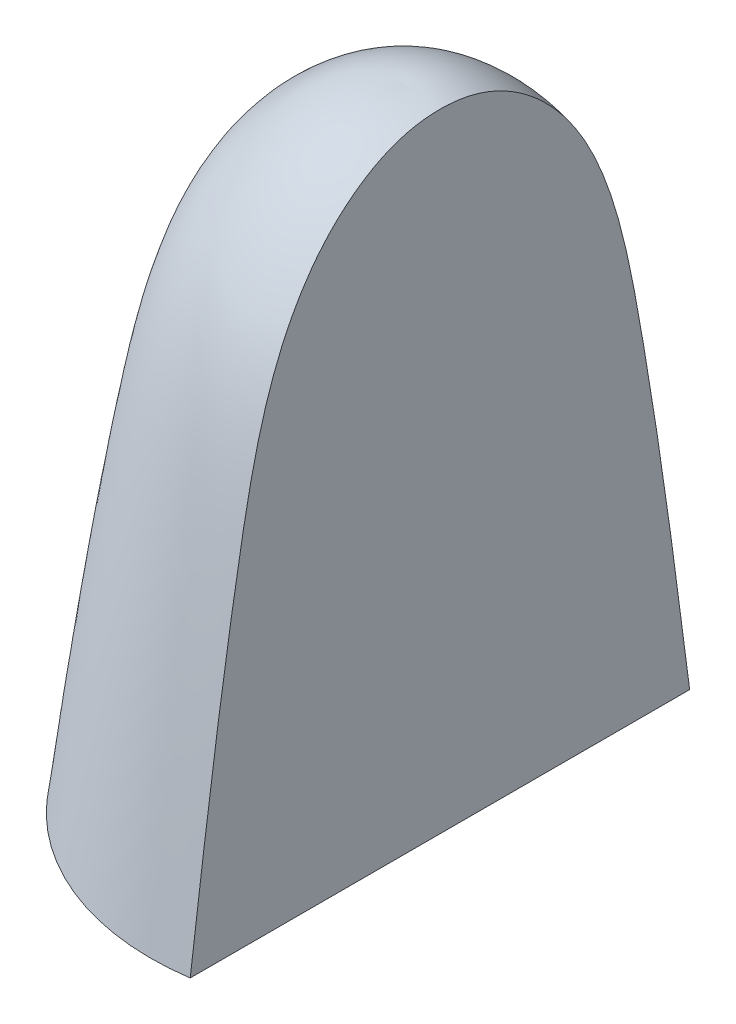
ISO-10303-21;
HEADER;
FILE_DESCRIPTION(('STEP AP214'),'2;1');
FILE_NAME('part.step','',(''),(''),'','','');
FILE_SCHEMA(('AUTOMOTIVE_DESIGN { 1 0 10303 214 1 1 1 1 }'));
ENDSEC;
DATA;
#1=APPLICATION_CONTEXT('core data for automotive mechanical design processes');
#2=APPLICATION_PROTOCOL_DEFINITION('international standard','automotive_design',2000,#1);
#3=PRODUCT_CONTEXT('',#1,'mechanical');
#4=PRODUCT('Part','Part','',(#3));
#5=PRODUCT_RELATED_PRODUCT_CATEGORY('part','',(#4));
#6=PRODUCT_DEFINITION_FORMATION('','',#4);
#7=PRODUCT_DEFINITION_CONTEXT('part definition',#1,'design');
#8=PRODUCT_DEFINITION('design','',#6,#7);
#9=PRODUCT_DEFINITION_SHAPE('','',#8);
#10=(LENGTH_UNIT() NAMED_UNIT(*) SI_UNIT(.MILLI.,.METRE.));
#11=(NAMED_UNIT(*) PLANE_ANGLE_UNIT() SI_UNIT($,.RADIAN.));
#12=(NAMED_UNIT(*) SI_UNIT($,.STERADIAN.) SOLID_ANGLE_UNIT());
#13=UNCERTAINTY_MEASURE_WITH_UNIT(LENGTH_MEASURE(1.E-05),#10,'distance_accuracy_value','');
#14=(GEOMETRIC_REPRESENTATION_CONTEXT(3) GLOBAL_UNCERTAINTY_ASSIGNED_CONTEXT((#13)) GLOBAL_UNIT_ASSIGNED_CONTEXT((#10,
#11,#12)) REPRESENTATION_CONTEXT('',''));
#15=CARTESIAN_POINT('',(0.,0.,0.));
#16=DIRECTION('',(0.,0.,1.));
#17=DIRECTION('',(1.,0.,0.));
#18=AXIS2_PLACEMENT_3D('',#15,#16,#17);
#19=CARTESIAN_POINT('',(4.88,0.,0.));
#20=DIRECTION('',(0.,1.,0.));
#21=DIRECTION('',(0.,0.,1.));
#22=AXIS2_PLACEMENT_3D('',#19,#20,#21);
#23=PLANE('',#22);
#24=DIRECTION('',(0.,0.,1.));
#25=VECTOR('',#24,1.);
#26=CARTESIAN_POINT('',(0.,0.,0.));
#27=LINE('',#26,#25);
#28=CARTESIAN_POINT('',(0.,0.,-4.88));
#29=VERTEX_POINT('',#28);
#30=CARTESIAN_POINT('',(0.,0.,4.88));
#31=VERTEX_POINT('',#30);
#32=EDGE_CURVE('E85',#29,#31,#27,.T.);
#33=ORIENTED_EDGE('',*,*,#32,.F.);
#34=CARTESIAN_POINT('',(0.,0.,0.));
#35=DIRECTION('',(0.,1.,0.));
#36=DIRECTION('',(0.,0.,1.));
#37=AXIS2_PLACEMENT_3D('',#34,#35,#36);
#38=CIRCLE('',#37,4.88);
#39=EDGE_CURVE('E88',#29,#31,#38,.T.);
#40=ORIENTED_EDGE('',*,*,#39,.T.);
#41=EDGE_LOOP('',(#33,#40));
#42=FACE_BOUND('',#41,.T.);
#43=DIRECTION('',(0.,0.,-1.));
#44=VECTOR('',#43,1.);
#45=CARTESIAN_POINT('',(1.,0.,0.));
#46=LINE('',#45,#44);
#47=CARTESIAN_POINT('',(1.,0.,6.8069376374402));
#48=VERTEX_POINT('',#47);
#49=CARTESIAN_POINT('',(1.,0.,-6.8069376374402));
#50=VERTEX_POINT('',#49);
#51=EDGE_CURVE('E52',#48,#50,#46,.T.);
#52=ORIENTED_EDGE('',*,*,#51,.F.);
#53=CARTESIAN_POINT('',(0.,0.,0.));
#54=DIRECTION('',(0.,1.,0.));
#55=DIRECTION('',(0.,0.,1.));
#56=AXIS2_PLACEMENT_3D('',#53,#54,#55);
#57=CIRCLE('',#56,6.88);
#58=EDGE_CURVE('E84',#50,#48,#57,.T.);
#59=ORIENTED_EDGE('',*,*,#58,.F.);
#60=EDGE_LOOP('',(#52,#59));
#61=FACE_BOUND('',#60,.T.);
#62=ADVANCED_FACE('F33',(#42,#61),#23,.F.);
#63=CARTESIAN_POINT('',(6.88,0.,0.));
#64=CARTESIAN_POINT('',(6.47690165518344,3.17769283241905,0.));
#65=CARTESIAN_POINT('',(5.80886829189499,8.35775424687315,0.));
#66=CARTESIAN_POINT('',(4.37828927648046,15.4645962006851,0.));
#67=CARTESIAN_POINT('',(1.11106057892877,17.2802335156458,0.));
#68=CARTESIAN_POINT('',(0.,17.2,0.));
#69=B_SPLINE_CURVE_WITH_KNOTS('',3,(#63,#64,#65,#66,#67,#68),.UNSPECIFIED.,.F.,.F.,(4,1,1,4),
(0.,0.473754928065121,0.83849243058151,1.),.UNSPECIFIED.);
#70=CARTESIAN_POINT('',(0.,18.0579057061154,0.));
#71=DIRECTION('',(0.,1.,0.));
#72=AXIS1_PLACEMENT('',#70,#71);
#73=SURFACE_OF_REVOLUTION('',#69,#72);
#74=CARTESIAN_POINT('',(0.,17.2,0.));
#75=VERTEX_POINT('',#74);
#76=VERTEX_LOOP('',#75);
#77=FACE_BOUND('',#76,.T.);
#78=CARTESIAN_POINT('',(1.,0.,-6.8069376374402));
#79=CARTESIAN_POINT('',(1.,0.325630724910655,-6.76518373550329));
#80=CARTESIAN_POINT('',(1.,0.651253473278133,-6.7233642438564));
#81=CARTESIAN_POINT('',(1.,1.30351985313046,-6.63913779643726));
#82=CARTESIAN_POINT('',(1.,1.63016329230628,-6.5967293532776));
#83=CARTESIAN_POINT('',(1.,2.28420434834058,-6.51102917643607));
#84=CARTESIAN_POINT('',(1.,2.61160170115588,-6.46773542117755));
#85=CARTESIAN_POINT('',(1.,3.26688126965538,-6.37995188866716));
#86=CARTESIAN_POINT('',(1.,3.59476319775362,-6.33545995928494));
#87=CARTESIAN_POINT('',(1.,4.25074316902371,-6.2449711752896));
#88=CARTESIAN_POINT('',(1.,4.5788409596492,-6.19897248531578));
#89=CARTESIAN_POINT('',(1.,5.2349861630474,-6.10517878849851));
#90=CARTESIAN_POINT('',(1.,5.56303342070914,-6.05738269418856));
#91=CARTESIAN_POINT('',(1.,6.23911470271178,-5.95671223634639));
#92=CARTESIAN_POINT('',(1.,6.58712922706167,-5.90370665303548));
#93=CARTESIAN_POINT('',(1.,7.28260491822555,-5.79510441209983));
#94=CARTESIAN_POINT('',(1.,7.63006625625954,-5.73950885409394));
#95=CARTESIAN_POINT('',(1.,8.15076053294847,-5.65400676545338));
#96=CARTESIAN_POINT('',(1.,8.3241691708583,-5.6251672410478));
#97=CARTESIAN_POINT('',(1.,8.67086436631517,-5.56675582456074));
#98=CARTESIAN_POINT('',(1.,8.84415092308082,-5.53718392783465));
#99=CARTESIAN_POINT('',(1.,9.10387448944329,-5.49228070846698));
#100=CARTESIAN_POINT('',(1.,9.1903603823503,-5.47723169501576));
#101=CARTESIAN_POINT('',(1.,9.36329907182524,-5.44694479601924));
#102=CARTESIAN_POINT('',(1.,9.4497518683796,-5.43170691039652));
#103=CARTESIAN_POINT('',(1.,9.70903044976889,-5.38554687526954));
#104=CARTESIAN_POINT('',(1.,9.8817775984942,-5.3541781471419));
#105=CARTESIAN_POINT('',(1.,10.2266383602988,-5.28943838767826));
#106=CARTESIAN_POINT('',(1.,10.3987525302671,-5.25607034908394));
#107=CARTESIAN_POINT('',(1.,10.7424036282819,-5.18643548096292));
#108=CARTESIAN_POINT('',(1.,10.9139405407412,-5.1501685738042));
#109=CARTESIAN_POINT('',(1.,11.2561398475446,-5.07386867623961));
#110=CARTESIAN_POINT('',(1.,11.4268024321778,-5.03383654551293));
#111=CARTESIAN_POINT('',(1.,11.7669547684463,-4.94908748588783));
#112=CARTESIAN_POINT('',(1.,11.9364446381214,-4.9043710360243));
#113=CARTESIAN_POINT('',(1.,12.2186448331177,-4.82483876658157));
#114=CARTESIAN_POINT('',(1.,12.3317910862566,-4.79156964529218));
#115=CARTESIAN_POINT('',(1.,12.5572074840467,-4.72216050903644));
#116=CARTESIAN_POINT('',(1.,12.6694775996119,-4.6860203992));
#117=CARTESIAN_POINT('',(1.,12.892949141258,-4.61054984847056));
#118=CARTESIAN_POINT('',(1.,13.0041505237877,-4.57121927817673));
#119=CARTESIAN_POINT('',(1.,13.2248506998165,-4.48918974666945));
#120=CARTESIAN_POINT('',(1.,13.3343541936387,-4.44650347075803));
#121=CARTESIAN_POINT('',(1.,13.5518114820349,-4.35730537690135));
#122=CARTESIAN_POINT('',(1.,13.6597651214702,-4.31079317907875));
#123=CARTESIAN_POINT('',(1.,13.873798179127,-4.21362034556357));
#124=CARTESIAN_POINT('',(1.,13.9798774630547,-4.1629594140761));
#125=CARTESIAN_POINT('',(1.,14.2442558566948,-4.02972818894831));
#126=CARTESIAN_POINT('',(1.,14.4011025571077,-3.94423618672721));
#127=CARTESIAN_POINT('',(1.,14.7081254864984,-3.76196383121557));
#128=CARTESIAN_POINT('',(0.999999999999999,14.858301920545,-3.66518382529215));
#129=CARTESIAN_POINT('',(1.,15.1502452259197,-3.45961208819087));
#130=CARTESIAN_POINT('',(1.00000000000001,15.2920120325885,-3.35082026467591));
#131=CARTESIAN_POINT('',(0.999999999999993,15.5651897070575,-3.12092349296525));
#132=CARTESIAN_POINT('',(0.999999999999972,15.6966036483847,-2.99982222379811));
#133=CARTESIAN_POINT('',(0.999999999999979,15.9090810342319,-2.78426965377604));
#134=CARTESIAN_POINT('',(0.999999999999995,15.9933027534781,-2.69291406131553));
#135=CARTESIAN_POINT('',(1.00000000000001,16.1551705918999,-2.50453400701932));
#136=CARTESIAN_POINT('',(1.,16.232817122197,-2.40750990025634));
#137=CARTESIAN_POINT('',(0.999999999999999,16.3803975765514,-2.20798317453374));
#138=CARTESIAN_POINT('',(1.,16.4503436940124,-2.10548960991976));
#139=CARTESIAN_POINT('',(1.,16.5814804128002,-1.89503426851931));
#140=CARTESIAN_POINT('',(1.,16.6426726862794,-1.78707354141495));
#141=CARTESIAN_POINT('',(1.,16.7458499010108,-1.58399007412601));
#142=CARTESIAN_POINT('',(1.,16.7893401615443,-1.48963244751748));
#143=CARTESIAN_POINT('',(1.,16.8684663428114,-1.2976860907947));
#144=CARTESIAN_POINT('',(1.,16.904104080725,-1.20009811425233));
#145=CARTESIAN_POINT('',(1.,16.9668758424214,-1.00217582353099));
#146=CARTESIAN_POINT('',(1.,16.9940067437563,-0.901840515598335));
#147=CARTESIAN_POINT('',(1.,17.0393553411734,-0.699169088723154));
#148=CARTESIAN_POINT('',(1.,17.0575725533354,-0.596832861465198));
#149=CARTESIAN_POINT('',(1.,17.085128351924,-0.390940077489392));
#150=CARTESIAN_POINT('',(1.,17.0944633649685,-0.287383046579562));
#151=CARTESIAN_POINT('',(1.,17.1045564194792,-0.0798435310542998));
#152=CARTESIAN_POINT('',(1.,17.1053131164444,0.0241390176988233));
#153=CARTESIAN_POINT('',(1.,17.0982910700647,0.231757145355891));
#154=CARTESIAN_POINT('',(1.,17.0905175908188,0.335392898704497));
#155=CARTESIAN_POINT('',(1.,17.0661386231189,0.541606437185932));
#156=CARTESIAN_POINT('',(1.,17.0495352248645,0.644184466845228));
#157=CARTESIAN_POINT('',(1.,17.0073986232804,0.847449796567969));
#158=CARTESIAN_POINT('',(1.,16.9818689106768,0.948137819542963));
#159=CARTESIAN_POINT('',(1.,16.9222004958238,1.14692926615582));
#160=CARTESIAN_POINT('',(1.,16.8880610864179,1.24503247675905));
#161=CARTESIAN_POINT('',(1.,16.811766122454,1.43817911998058));
#162=CARTESIAN_POINT('',(1.,16.7696020313018,1.53321916697461));
#163=CARTESIAN_POINT('',(1.,16.6780378957834,1.71978317009742));
#164=CARTESIAN_POINT('',(1.,16.6286340991481,1.81130527167035));
#165=CARTESIAN_POINT('',(1.,16.5048092158707,2.02220966681855));
#166=CARTESIAN_POINT('',(1.,16.4277118126913,2.14002724153519));
#167=CARTESIAN_POINT('',(1.,16.2635424264656,2.36844283285249));
#168=CARTESIAN_POINT('',(1.,16.1764668513271,2.47903822686907));
#169=CARTESIAN_POINT('',(1.,15.9024935010686,2.79990233734617));
#170=CARTESIAN_POINT('',(1.,15.7027358619353,2.99943418646462));
#171=CARTESIAN_POINT('',(1.,15.3928056084428,3.26757693012212));
#172=CARTESIAN_POINT('',(1.,15.2928353835745,3.34848066450858));
#173=CARTESIAN_POINT('',(1.,15.0880346673323,3.50403566921137));
#174=CARTESIAN_POINT('',(1.,14.9832020688562,3.57868418876094));
#175=CARTESIAN_POINT('',(1.,14.7694244196884,3.72184897244149));
#176=CARTESIAN_POINT('',(1.,14.6604785067774,3.79036394061711));
#177=CARTESIAN_POINT('',(1.,14.4388365611266,3.92171580713985));
#178=CARTESIAN_POINT('',(1.,14.3261314030833,3.98453726772779));
#179=CARTESIAN_POINT('',(1.,14.0978636756859,4.10463869346656));
#180=CARTESIAN_POINT('',(1.,13.982302057936,4.16192047368718));
#181=CARTESIAN_POINT('',(1.,13.7488770930997,4.27133055660323));
#182=CARTESIAN_POINT('',(1.,13.6310154056141,4.32346242170285));
#183=CARTESIAN_POINT('',(1.,13.2187402211602,4.49621877597788));
#184=CARTESIAN_POINT('',(1.,12.9193164074057,4.60495871881363));
#185=CARTESIAN_POINT('',(1.,12.313160346503,4.80051813553175));
#186=CARTESIAN_POINT('',(1.,12.0064175984661,4.88730374723454));
#187=CARTESIAN_POINT('',(1.,11.3877766589818,5.04509578818482));
#188=CARTESIAN_POINT('',(1.,11.075863653563,5.11604299756951));
#189=CARTESIAN_POINT('',(1.,10.6059487597747,5.21451770021536));
#190=CARTESIAN_POINT('',(1.,10.44875454059,5.24605568024259));
#191=CARTESIAN_POINT('',(1.,10.1339696996392,5.3070980812102));
#192=CARTESIAN_POINT('',(1.,9.97637907758946,5.33660250069485));
#193=CARTESIAN_POINT('',(1.,9.66095238364621,5.39421614948321));
#194=CARTESIAN_POINT('',(1.,9.50311632095862,5.42232542987273));
#195=CARTESIAN_POINT('',(1.,9.1873236436048,5.47785375048928));
#196=CARTESIAN_POINT('',(1.,9.02936702926569,5.50527279258253));
#197=CARTESIAN_POINT('',(1.,8.71157512891945,5.55980887427358));
#198=CARTESIAN_POINT('',(1.,8.55173866698994,5.58691906383199));
#199=CARTESIAN_POINT('',(1.,8.23196174349966,5.64051646427551));
#200=CARTESIAN_POINT('',(1.,8.0720212821457,5.66700367639563));
#201=CARTESIAN_POINT('',(1.,7.59287945564179,5.74542981041913));
#202=CARTESIAN_POINT('',(1.,7.27353140934863,5.79647483299838));
#203=CARTESIAN_POINT('',(1.,6.63500901646421,5.89627368474961));
#204=CARTESIAN_POINT('',(1.,6.31583522837623,5.94503109613245));
#205=CARTESIAN_POINT('',(1.,5.67740543995403,6.04053663011164));
#206=CARTESIAN_POINT('',(1.,5.35814963671147,6.08728607220366));
#207=CARTESIAN_POINT('',(1.,4.71930413137382,6.17908284350568));
#208=CARTESIAN_POINT('',(1.,4.39971436154091,6.22412970045101));
#209=CARTESIAN_POINT('',(1.,3.90926493029905,6.29214406194618));
#210=CARTESIAN_POINT('',(1.,3.73847568222654,6.31562131142407));
#211=CARTESIAN_POINT('',(1.,3.3967632415407,6.36222687449056));
#212=CARTESIAN_POINT('',(1.,3.22584002451562,6.38535500914882));
#213=CARTESIAN_POINT('',(1.,2.88389480560939,6.43130515751945));
#214=CARTESIAN_POINT('',(1.,2.71287278976421,6.45412706721072));
#215=CARTESIAN_POINT('',(1.,2.37076516339941,6.49950840024231));
#216=CARTESIAN_POINT('',(1.,2.19967954703954,6.52206777952893));
#217=CARTESIAN_POINT('',(1.,1.85950073294312,6.56670266264592));
#218=CARTESIAN_POINT('',(1.,1.69040787189081,6.58878073443648));
#219=CARTESIAN_POINT('',(1.,1.35222856661231,6.63276507481999));
#220=CARTESIAN_POINT('',(1.,1.18314212603904,6.65467137151688));
#221=CARTESIAN_POINT('',(1.,0.845009687406819,6.69835319024418));
#222=CARTESIAN_POINT('',(1.,0.675963694661787,6.72012875344397));
#223=CARTESIAN_POINT('',(1.,0.337945932863498,6.76358837022412));
#224=CARTESIAN_POINT('',(1.,0.168974168998467,6.78527246414375));
#225=CARTESIAN_POINT('',(1.,0.,6.8069376374402));
#226=B_SPLINE_CURVE_WITH_KNOTS('',3,(#78,#79,#80,#81,#82,#83,#84,#85,#86,#87,#88,#89,#90,#91,
#92,#93,#94,#95,#96,#97,#98,#99,#100,#101,#102,#103,#104,#105,#106,#107,#108,#109,#110,#111,
#112,#113,#114,#115,#116,#117,#118,#119,#120,#121,#122,#123,#124,#125,#126,#127,#128,#129,#130,
#131,#132,#133,#134,#135,#136,#137,#138,#139,#140,#141,#142,#143,#144,#145,#146,#147,#148,#149,
#150,#151,#152,#153,#154,#155,#156,#157,#158,#159,#160,#161,#162,#163,#164,#165,#166,#167,#168,
#169,#170,#171,#172,#173,#174,#175,#176,#177,#178,#179,#180,#181,#182,#183,#184,#185,#186,#187,
#188,#189,#190,#191,#192,#193,#194,#195,#196,#197,#198,#199,#200,#201,#202,#203,#204,#205,#206,
#207,#208,#209,#210,#211,#212,#213,#214,#215,#216,#217,#218,#219,#220,#221,#222,#223,#224,#225),
.UNSPECIFIED.,.F.,.F.,(4,2,2,2,2,2,2,2,2,2,2,2,2,2,2,2,2,2,2,2,2,2,2,2,2,2,2,2,2,2,2,2,2,2,2,2,
2,2,2,2,2,2,2,2,2,2,2,2,2,2,2,2,2,2,2,2,2,2,2,2,2,2,2,2,2,2,2,2,2,2,2,2,2,4),(0.,
0.984890943744065,1.97304523803312,2.96378620094933,3.95644417958091,4.95035988641057,
5.94488692536696,7.00096224815413,8.05659321093775,8.58396321759192,9.11133656961654,
9.37469266193548,9.63804886222473,10.1647576953517,10.690696901358,11.2166501967967,
11.742483696285,12.2682634745952,12.6220393819107,12.975826984407,13.3296289432399,
13.682152432191,14.0347109656917,14.3872946577023,14.922752745355,15.4581943596352,
15.9936400902422,16.5289262555884,16.9014215957282,17.273893627923,17.6457671093511,
18.0175694606791,18.3289464358566,18.640251278337,18.9516702523532,19.2631061312907,
19.5746672505479,19.8862772008878,20.1976949601657,20.5090390340906,20.8202614896727,
21.1315095158048,21.443090514829,21.7548335781879,22.1765785781657,22.598475884064,
23.4416265896366,23.8272861979642,24.2131145218962,24.5990241758597,24.9859507228708,
25.3727500612588,25.759279933286,26.7136298536801,27.6694429019495,28.628772014043,
29.1097456406348,29.5907196115311,30.0716759575908,30.5526310031282,31.0389875177998,
31.5253430682212,32.495539379721,33.4641619466859,34.4321379483444,35.4003805065352,
35.917566166168,36.4350084643139,36.9526222952441,37.4703217665807,37.9819059960161,
38.4934047020968,39.0047328563696,39.5158051387089),.UNSPECIFIED.);
#227=EDGE_CURVE('E11',#50,#48,#226,.T.);
#228=ORIENTED_EDGE('',*,*,#227,.F.);
#229=ORIENTED_EDGE('',*,*,#58,.T.);
#230=EDGE_LOOP('',(#228,#229));
#231=FACE_BOUND('',#230,.T.);
#232=ADVANCED_FACE('F87',(#77,#231),#73,.T.);
#233=CARTESIAN_POINT('',(0.,0.803124562942561,0.));
#234=DIRECTION('',(0.,1.,0.));
#235=DIRECTION('',(0.,0.,1.));
#236=AXIS2_PLACEMENT_3D('',#233,#234,#235);
#237=DEGENERATE_TOROIDAL_SURFACE('',#236,7.58838532482872,12.4942243325468,.F.);
#238=CARTESIAN_POINT('',(0.,0.803124562942561,7.58838532482872));
#239=DIRECTION('',(1.,0.,0.));
#240=DIRECTION('',(0.,0.,-1.));
#241=AXIS2_PLACEMENT_3D('',#238,#239,#240);
#242=CIRCLE('',#241,12.4942243325468);
#243=CARTESIAN_POINT('',(0.,1.60624912588512,-4.88));
#244=VERTEX_POINT('',#243);
#245=EDGE_CURVE('E113',#244,#29,#242,.F.);
#246=ORIENTED_EDGE('',*,*,#245,.F.);
#247=CARTESIAN_POINT('',(0.,1.60624912588512,0.));
#248=DIRECTION('',(0.,1.,0.));
#249=DIRECTION('',(0.,0.,1.));
#250=AXIS2_PLACEMENT_3D('',#247,#248,#249);
#251=CIRCLE('',#250,4.88);
#252=CARTESIAN_POINT('',(0.,1.60624912588512,4.88));
#253=VERTEX_POINT('',#252);
#254=EDGE_CURVE('E95',#244,#253,#251,.T.);
#255=ORIENTED_EDGE('',*,*,#254,.T.);
#256=CARTESIAN_POINT('',(0.,0.803124562942561,-7.58838532482872));
#257=DIRECTION('',(1.,0.,0.));
#258=DIRECTION('',(0.,0.,-1.));
#259=AXIS2_PLACEMENT_3D('',#256,#257,#258);
#260=CIRCLE('',#259,12.4942243325468);
#261=EDGE_CURVE('E124',#31,#253,#260,.F.);
#262=ORIENTED_EDGE('',*,*,#261,.F.);
#263=ORIENTED_EDGE('',*,*,#39,.F.);
#264=EDGE_LOOP('',(#246,#255,#262,#263));
#265=FACE_BOUND('',#264,.T.);
#266=ADVANCED_FACE('F35',(#265),#237,.T.);
#267=CARTESIAN_POINT('',(0.,15.4,0.));
#268=CARTESIAN_POINT('',(1.56302961911326,15.2977602080588,0.));
#269=CARTESIAN_POINT('',(2.28424319668184,13.6331974498387,0.));
#270=B_SPLINE_CURVE_WITH_KNOTS('',2,(#267,#268,#269),.UNSPECIFIED.,.F.,.F.,(3,3),(0.,1.),.UNSPECIFIED.);
#271=CARTESIAN_POINT('',(0.,18.0579057061154,0.));
#272=DIRECTION('',(0.,1.,0.));
#273=AXIS1_PLACEMENT('',#271,#272);
#274=SURFACE_OF_REVOLUTION('',#270,#273);
#275=CARTESIAN_POINT('',(0.,15.4,0.));
#276=CARTESIAN_POINT('',(0.,15.2977602080588,-1.56302961911326));
#277=CARTESIAN_POINT('',(0.,13.6331974498387,-2.28424319668184));
#278=B_SPLINE_CURVE_WITH_KNOTS('',2,(#275,#276,#277),.UNSPECIFIED.,.F.,.F.,(3,3),(0.,1.),.UNSPECIFIED.);
#279=CARTESIAN_POINT('',(0.,15.4,0.));
#280=VERTEX_POINT('',#279);
#281=CARTESIAN_POINT('',(0.,13.6331974498387,-2.28424319668184));
#282=VERTEX_POINT('',#281);
#283=EDGE_CURVE('E116',#280,#282,#278,.T.);
#284=ORIENTED_EDGE('',*,*,#283,.F.);
#285=CARTESIAN_POINT('',(0.,15.4,0.));
#286=CARTESIAN_POINT('',(0.,15.2977602080588,1.56302961911326));
#287=CARTESIAN_POINT('',(0.,13.6331974498387,2.28424319668184));
#288=B_SPLINE_CURVE_WITH_KNOTS('',2,(#285,#286,#287),.UNSPECIFIED.,.F.,.F.,(3,3),(0.,1.),.UNSPECIFIED.);
#289=CARTESIAN_POINT('',(0.,13.6331974498387,2.28424319668184));
#290=VERTEX_POINT('',#289);
#291=EDGE_CURVE('E160',#290,#280,#288,.F.);
#292=ORIENTED_EDGE('',*,*,#291,.F.);
#293=CARTESIAN_POINT('',(0.,13.6331974498387,0.));
#294=DIRECTION('',(0.,1.,0.));
#295=DIRECTION('',(0.,0.,1.));
#296=AXIS2_PLACEMENT_3D('',#293,#294,#295);
#297=CIRCLE('',#296,2.28424319668184);
#298=EDGE_CURVE('E89',#282,#290,#297,.T.);
#299=ORIENTED_EDGE('',*,*,#298,.F.);
#300=EDGE_LOOP('',(#284,#292,#299));
#301=FACE_BOUND('',#300,.T.);
#302=ADVANCED_FACE('F144',(#301),#274,.T.);
#303=CARTESIAN_POINT('',(2.28424319668184,13.6331974498387,0.));
#304=CARTESIAN_POINT('',(4.26625949687921,7.77835124400765,0.));
#305=CARTESIAN_POINT('',(4.88,1.60624912588512,0.));
#306=B_SPLINE_CURVE_WITH_KNOTS('',2,(#303,#304,#305),.UNSPECIFIED.,.F.,.F.,(3,3),(0.,1.),.UNSPECIFIED.);
#307=CARTESIAN_POINT('',(0.,18.0579057061154,0.));
#308=DIRECTION('',(0.,1.,0.));
#309=AXIS1_PLACEMENT('',#307,#308);
#310=SURFACE_OF_REVOLUTION('',#306,#309);
#311=CARTESIAN_POINT('',(0.,13.6331974498387,-2.28424319668184));
#312=CARTESIAN_POINT('',(0.,7.77835124400765,-4.26625949687921));
#313=CARTESIAN_POINT('',(0.,1.60624912588512,-4.88));
#314=B_SPLINE_CURVE_WITH_KNOTS('',2,(#311,#312,#313),.UNSPECIFIED.,.F.,.F.,(3,3),(0.,1.),.UNSPECIFIED.);
#315=EDGE_CURVE('E47',#282,#244,#314,.T.);
#316=ORIENTED_EDGE('',*,*,#315,.F.);
#317=ORIENTED_EDGE('',*,*,#298,.T.);
#318=CARTESIAN_POINT('',(0.,13.6331974498387,2.28424319668184));
#319=CARTESIAN_POINT('',(0.,7.77835124400765,4.26625949687921));
#320=CARTESIAN_POINT('',(0.,1.60624912588512,4.88));
#321=B_SPLINE_CURVE_WITH_KNOTS('',2,(#318,#319,#320),.UNSPECIFIED.,.F.,.F.,(3,3),(0.,1.),.UNSPECIFIED.);
#322=EDGE_CURVE('E92',#253,#290,#321,.F.);
#323=ORIENTED_EDGE('',*,*,#322,.F.);
#324=ORIENTED_EDGE('',*,*,#254,.F.);
#325=EDGE_LOOP('',(#316,#317,#323,#324));
#326=FACE_BOUND('',#325,.T.);
#327=ADVANCED_FACE('F127',(#326),#310,.T.);
#328=CARTESIAN_POINT('',(0.,9.80955029560996,5.45943951485915));
#329=DIRECTION('',(1.,0.,0.));
#330=DIRECTION('',(0.,0.,-1.));
#331=AXIS2_PLACEMENT_3D('',#328,#329,#330);
#332=PLANE('',#331);
#333=ORIENTED_EDGE('',*,*,#315,.T.);
#334=ORIENTED_EDGE('',*,*,#245,.T.);
#335=ORIENTED_EDGE('',*,*,#32,.T.);
#336=ORIENTED_EDGE('',*,*,#261,.T.);
#337=ORIENTED_EDGE('',*,*,#322,.T.);
#338=ORIENTED_EDGE('',*,*,#291,.T.);
#339=ORIENTED_EDGE('',*,*,#283,.T.);
#340=EDGE_LOOP('',(#333,#334,#335,#336,#337,#338,#339));
#341=FACE_BOUND('',#340,.T.);
#342=ADVANCED_FACE('F112',(#341),#332,.F.);
#343=CARTESIAN_POINT('',(1.,0.,0.));
#344=DIRECTION('',(1.,0.,0.));
#345=DIRECTION('',(0.,0.,-1.));
#346=AXIS2_PLACEMENT_3D('',#343,#344,#345);
#347=PLANE('',#346);
#348=ORIENTED_EDGE('',*,*,#51,.T.);
#349=ORIENTED_EDGE('',*,*,#227,.T.);
#350=EDGE_LOOP('',(#348,#349));
#351=FACE_BOUND('',#350,.T.);
#352=ADVANCED_FACE('F79',(#351),#347,.T.);
#353=CLOSED_SHELL('',(#62,#232,#266,#302,#327,#342,#352));
#354=MANIFOLD_SOLID_BREP('B2',#353);
#355=ADVANCED_BREP_SHAPE_REPRESENTATION('',(#18,#354),#14);
#356=SHAPE_DEFINITION_REPRESENTATION(#9,#355);
ENDSEC;
END-ISO-10303-21;
